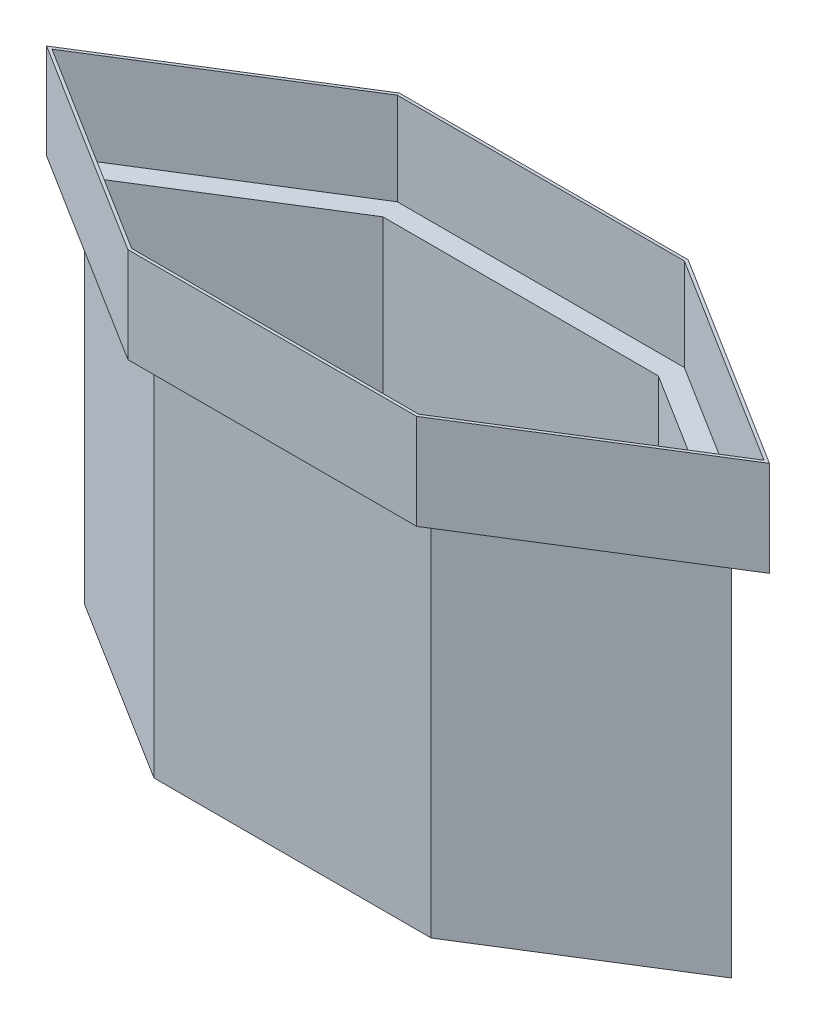
ISO-10303-21;
HEADER;
FILE_DESCRIPTION(('STEP AP214'),'2;1');
FILE_NAME('part.step','',(''),(''),'','','');
FILE_SCHEMA(('AUTOMOTIVE_DESIGN { 1 0 10303 214 1 1 1 1 }'));
ENDSEC;
DATA;
#1=APPLICATION_CONTEXT('core data for automotive mechanical design processes');
#2=APPLICATION_PROTOCOL_DEFINITION('international standard','automotive_design',2000,#1);
#3=PRODUCT_CONTEXT('',#1,'mechanical');
#4=PRODUCT('Part','Part','',(#3));
#5=PRODUCT_RELATED_PRODUCT_CATEGORY('part','',(#4));
#6=PRODUCT_DEFINITION_FORMATION('','',#4);
#7=PRODUCT_DEFINITION_CONTEXT('part definition',#1,'design');
#8=PRODUCT_DEFINITION('design','',#6,#7);
#9=PRODUCT_DEFINITION_SHAPE('','',#8);
#10=(LENGTH_UNIT() NAMED_UNIT(*) SI_UNIT(.MILLI.,.METRE.));
#11=(NAMED_UNIT(*) PLANE_ANGLE_UNIT() SI_UNIT($,.RADIAN.));
#12=(NAMED_UNIT(*) SI_UNIT($,.STERADIAN.) SOLID_ANGLE_UNIT());
#13=UNCERTAINTY_MEASURE_WITH_UNIT(LENGTH_MEASURE(1.E-05),#10,'distance_accuracy_value','');
#14=(GEOMETRIC_REPRESENTATION_CONTEXT(3) GLOBAL_UNCERTAINTY_ASSIGNED_CONTEXT((#13)) GLOBAL_UNIT_ASSIGNED_CONTEXT((#10,
#11,#12)) REPRESENTATION_CONTEXT('',''));
#15=CARTESIAN_POINT('',(0.,0.,0.));
#16=DIRECTION('',(0.,0.,1.));
#17=DIRECTION('',(1.,0.,0.));
#18=AXIS2_PLACEMENT_3D('',#15,#16,#17);
#19=CARTESIAN_POINT('',(152.4,3.175,-127.));
#20=DIRECTION('',(0.,0.,1.));
#21=DIRECTION('',(1.,0.,0.));
#22=AXIS2_PLACEMENT_3D('',#19,#20,#21);
#23=PLANE('',#22);
#24=DIRECTION('',(-1.,0.,0.));
#25=VECTOR('',#24,1.);
#26=CARTESIAN_POINT('',(152.4,0.,-127.));
#27=LINE('',#26,#25);
#28=CARTESIAN_POINT('',(152.4,0.,-127.));
#29=VERTEX_POINT('',#28);
#30=CARTESIAN_POINT('',(-152.4,0.,-127.));
#31=VERTEX_POINT('',#30);
#32=EDGE_CURVE('E357',#29,#31,#27,.T.);
#33=ORIENTED_EDGE('',*,*,#32,.T.);
#34=DIRECTION('',(0.,-1.,0.));
#35=VECTOR('',#34,1.);
#36=CARTESIAN_POINT('',(-152.4,3.175,-127.));
#37=LINE('',#36,#35);
#38=CARTESIAN_POINT('',(-152.4,406.4,-127.));
#39=VERTEX_POINT('',#38);
#40=EDGE_CURVE('E11',#39,#31,#37,.T.);
#41=ORIENTED_EDGE('',*,*,#40,.F.);
#42=DIRECTION('',(-1.,0.,0.));
#43=VECTOR('',#42,1.);
#44=CARTESIAN_POINT('',(152.4,406.4,-127.));
#45=LINE('',#44,#43);
#46=CARTESIAN_POINT('',(152.4,406.4,-127.));
#47=VERTEX_POINT('',#46);
#48=EDGE_CURVE('E348',#47,#39,#45,.T.);
#49=ORIENTED_EDGE('',*,*,#48,.F.);
#50=DIRECTION('',(0.,-1.,0.));
#51=VECTOR('',#50,1.);
#52=CARTESIAN_POINT('',(152.4,3.175,-127.));
#53=LINE('',#52,#51);
#54=EDGE_CURVE('E370',#47,#29,#53,.T.);
#55=ORIENTED_EDGE('',*,*,#54,.T.);
#56=EDGE_LOOP('',(#33,#41,#49,#55));
#57=FACE_BOUND('',#56,.T.);
#58=ADVANCED_FACE('F32',(#57),#23,.F.);
#59=CARTESIAN_POINT('',(-152.4,3.175,-127.));
#60=DIRECTION('',(0.52999894000318,0.,0.847998304005088));
#61=DIRECTION('',(0.847998304005088,0.,-0.52999894000318));
#62=AXIS2_PLACEMENT_3D('',#59,#60,#61);
#63=PLANE('',#62);
#64=DIRECTION('',(-0.847998304005088,0.,0.52999894000318));
#65=VECTOR('',#64,1.);
#66=CARTESIAN_POINT('',(-152.4,0.,-127.));
#67=LINE('',#66,#65);
#68=CARTESIAN_POINT('',(-355.6,0.,0.));
#69=VERTEX_POINT('',#68);
#70=EDGE_CURVE('E360',#31,#69,#67,.T.);
#71=ORIENTED_EDGE('',*,*,#70,.T.);
#72=DIRECTION('',(0.,-1.,0.));
#73=VECTOR('',#72,1.);
#74=CARTESIAN_POINT('',(-355.6,3.175,0.));
#75=LINE('',#74,#73);
#76=CARTESIAN_POINT('',(-355.6,406.4,0.));
#77=VERTEX_POINT('',#76);
#78=EDGE_CURVE('E39',#77,#69,#75,.T.);
#79=ORIENTED_EDGE('',*,*,#78,.F.);
#80=DIRECTION('',(-0.847998304005088,0.,0.52999894000318));
#81=VECTOR('',#80,1.);
#82=CARTESIAN_POINT('',(-152.4,406.4,-127.));
#83=LINE('',#82,#81);
#84=EDGE_CURVE('E351',#39,#77,#83,.T.);
#85=ORIENTED_EDGE('',*,*,#84,.F.);
#86=ORIENTED_EDGE('',*,*,#40,.T.);
#87=EDGE_LOOP('',(#71,#79,#85,#86));
#88=FACE_BOUND('',#87,.T.);
#89=ADVANCED_FACE('F403',(#88),#63,.F.);
#90=CARTESIAN_POINT('',(-355.6,3.175,0.));
#91=DIRECTION('',(0.52999894000318,0.,-0.847998304005088));
#92=DIRECTION('',(-0.847998304005088,0.,-0.52999894000318));
#93=AXIS2_PLACEMENT_3D('',#90,#91,#92);
#94=PLANE('',#93);
#95=DIRECTION('',(0.847998304005088,0.,0.52999894000318));
#96=VECTOR('',#95,1.);
#97=CARTESIAN_POINT('',(-355.6,0.,0.));
#98=LINE('',#97,#96);
#99=CARTESIAN_POINT('',(-152.4,0.,127.));
#100=VERTEX_POINT('',#99);
#101=EDGE_CURVE('E362',#69,#100,#98,.T.);
#102=ORIENTED_EDGE('',*,*,#101,.T.);
#103=DIRECTION('',(0.,-1.,0.));
#104=VECTOR('',#103,1.);
#105=CARTESIAN_POINT('',(-152.4,3.175,127.));
#106=LINE('',#105,#104);
#107=CARTESIAN_POINT('',(-152.4,406.4,127.));
#108=VERTEX_POINT('',#107);
#109=EDGE_CURVE('E379',#108,#100,#106,.T.);
#110=ORIENTED_EDGE('',*,*,#109,.F.);
#111=DIRECTION('',(0.847998304005088,0.,0.52999894000318));
#112=VECTOR('',#111,1.);
#113=CARTESIAN_POINT('',(-355.6,406.4,0.));
#114=LINE('',#113,#112);
#115=EDGE_CURVE('E354',#77,#108,#114,.T.);
#116=ORIENTED_EDGE('',*,*,#115,.F.);
#117=ORIENTED_EDGE('',*,*,#78,.T.);
#118=EDGE_LOOP('',(#102,#110,#116,#117));
#119=FACE_BOUND('',#118,.T.);
#120=ADVANCED_FACE('F385',(#119),#94,.F.);
#121=CARTESIAN_POINT('',(152.4,3.175,127.));
#122=DIRECTION('',(0.,0.,-1.));
#123=DIRECTION('',(-1.,0.,0.));
#124=AXIS2_PLACEMENT_3D('',#121,#122,#123);
#125=PLANE('',#124);
#126=DIRECTION('',(1.,0.,0.));
#127=VECTOR('',#126,1.);
#128=CARTESIAN_POINT('',(152.4,0.,127.));
#129=LINE('',#128,#127);
#130=CARTESIAN_POINT('',(152.4,0.,127.));
#131=VERTEX_POINT('',#130);
#132=EDGE_CURVE('E364',#100,#131,#129,.T.);
#133=ORIENTED_EDGE('',*,*,#132,.T.);
#134=DIRECTION('',(0.,-1.,0.));
#135=VECTOR('',#134,1.);
#136=CARTESIAN_POINT('',(152.4,3.175,127.));
#137=LINE('',#136,#135);
#138=CARTESIAN_POINT('',(152.4,406.4,127.));
#139=VERTEX_POINT('',#138);
#140=EDGE_CURVE('E376',#139,#131,#137,.T.);
#141=ORIENTED_EDGE('',*,*,#140,.F.);
#142=DIRECTION('',(1.,0.,0.));
#143=VECTOR('',#142,1.);
#144=CARTESIAN_POINT('',(-152.4,406.4,127.));
#145=LINE('',#144,#143);
#146=EDGE_CURVE('E339',#108,#139,#145,.T.);
#147=ORIENTED_EDGE('',*,*,#146,.F.);
#148=ORIENTED_EDGE('',*,*,#109,.T.);
#149=EDGE_LOOP('',(#133,#141,#147,#148));
#150=FACE_BOUND('',#149,.T.);
#151=ADVANCED_FACE('F395',(#150),#125,.F.);
#152=CARTESIAN_POINT('',(355.6,3.175,0.));
#153=DIRECTION('',(-0.52999894000318,0.,-0.847998304005088));
#154=DIRECTION('',(-0.847998304005088,0.,0.52999894000318));
#155=AXIS2_PLACEMENT_3D('',#152,#153,#154);
#156=PLANE('',#155);
#157=DIRECTION('',(0.847998304005088,0.,-0.52999894000318));
#158=VECTOR('',#157,1.);
#159=CARTESIAN_POINT('',(355.6,0.,0.));
#160=LINE('',#159,#158);
#161=CARTESIAN_POINT('',(355.6,0.,0.));
#162=VERTEX_POINT('',#161);
#163=EDGE_CURVE('E366',#131,#162,#160,.T.);
#164=ORIENTED_EDGE('',*,*,#163,.T.);
#165=DIRECTION('',(0.,-1.,0.));
#166=VECTOR('',#165,1.);
#167=CARTESIAN_POINT('',(355.6,3.175,0.));
#168=LINE('',#167,#166);
#169=CARTESIAN_POINT('',(355.6,406.4,0.));
#170=VERTEX_POINT('',#169);
#171=EDGE_CURVE('E373',#170,#162,#168,.T.);
#172=ORIENTED_EDGE('',*,*,#171,.F.);
#173=DIRECTION('',(0.847998304005088,0.,-0.52999894000318));
#174=VECTOR('',#173,1.);
#175=CARTESIAN_POINT('',(152.4,406.4,127.));
#176=LINE('',#175,#174);
#177=EDGE_CURVE('E342',#139,#170,#176,.T.);
#178=ORIENTED_EDGE('',*,*,#177,.F.);
#179=ORIENTED_EDGE('',*,*,#140,.T.);
#180=EDGE_LOOP('',(#164,#172,#178,#179));
#181=FACE_BOUND('',#180,.T.);
#182=ADVANCED_FACE('F399',(#181),#156,.F.);
#183=CARTESIAN_POINT('',(152.4,3.175,-127.));
#184=DIRECTION('',(-0.52999894000318,0.,0.847998304005088));
#185=DIRECTION('',(0.847998304005088,0.,0.52999894000318));
#186=AXIS2_PLACEMENT_3D('',#183,#184,#185);
#187=PLANE('',#186);
#188=DIRECTION('',(-0.847998304005088,0.,-0.52999894000318));
#189=VECTOR('',#188,1.);
#190=CARTESIAN_POINT('',(152.4,0.,-127.));
#191=LINE('',#190,#189);
#192=EDGE_CURVE('E368',#162,#29,#191,.T.);
#193=ORIENTED_EDGE('',*,*,#192,.T.);
#194=ORIENTED_EDGE('',*,*,#54,.F.);
#195=DIRECTION('',(-0.847998304005088,0.,-0.52999894000318));
#196=VECTOR('',#195,1.);
#197=CARTESIAN_POINT('',(355.6,406.4,0.));
#198=LINE('',#197,#196);
#199=EDGE_CURVE('E345',#170,#47,#198,.T.);
#200=ORIENTED_EDGE('',*,*,#199,.F.);
#201=ORIENTED_EDGE('',*,*,#171,.T.);
#202=EDGE_LOOP('',(#193,#194,#200,#201));
#203=FACE_BOUND('',#202,.T.);
#204=ADVANCED_FACE('F407',(#203),#187,.F.);
#205=CARTESIAN_POINT('',(0.,0.,0.));
#206=DIRECTION('',(0.,1.,0.));
#207=DIRECTION('',(0.,0.,1.));
#208=AXIS2_PLACEMENT_3D('',#205,#206,#207);
#209=PLANE('',#208);
#210=ORIENTED_EDGE('',*,*,#32,.F.);
#211=ORIENTED_EDGE('',*,*,#192,.F.);
#212=ORIENTED_EDGE('',*,*,#163,.F.);
#213=ORIENTED_EDGE('',*,*,#132,.F.);
#214=ORIENTED_EDGE('',*,*,#101,.F.);
#215=ORIENTED_EDGE('',*,*,#70,.F.);
#216=EDGE_LOOP('',(#210,#211,#212,#213,#214,#215));
#217=FACE_BOUND('',#216,.T.);
#218=ADVANCED_FACE('F391',(#217),#209,.F.);
#219=CARTESIAN_POINT('',(0.,406.4,0.));
#220=DIRECTION('',(0.,1.,0.));
#221=DIRECTION('',(0.,0.,1.));
#222=AXIS2_PLACEMENT_3D('',#219,#220,#221);
#223=PLANE('',#222);
#224=DIRECTION('',(-0.847998304005088,0.,-0.52999894000318));
#225=VECTOR('',#224,1.);
#226=CARTESIAN_POINT('',(397.534046131991,406.4,0.));
#227=LINE('',#226,#225);
#228=CARTESIAN_POINT('',(397.534046131991,406.4,0.));
#229=VERTEX_POINT('',#228);
#230=CARTESIAN_POINT('',(158.774046131992,406.4,-149.225));
#231=VERTEX_POINT('',#230);
#232=EDGE_CURVE('E278',#229,#231,#227,.T.);
#233=ORIENTED_EDGE('',*,*,#232,.F.);
#234=DIRECTION('',(0.847998304005088,0.,-0.52999894000318));
#235=VECTOR('',#234,1.);
#236=CARTESIAN_POINT('',(158.774046131992,406.4,149.225));
#237=LINE('',#236,#235);
#238=CARTESIAN_POINT('',(158.774046131992,406.4,149.225));
#239=VERTEX_POINT('',#238);
#240=EDGE_CURVE('E289',#239,#229,#237,.T.);
#241=ORIENTED_EDGE('',*,*,#240,.F.);
#242=DIRECTION('',(1.,0.,0.));
#243=VECTOR('',#242,1.);
#244=CARTESIAN_POINT('',(-158.774046131992,406.4,149.225));
#245=LINE('',#244,#243);
#246=CARTESIAN_POINT('',(-158.774046131992,406.4,149.225));
#247=VERTEX_POINT('',#246);
#248=EDGE_CURVE('E287',#247,#239,#245,.T.);
#249=ORIENTED_EDGE('',*,*,#248,.F.);
#250=DIRECTION('',(0.847998304005088,0.,0.52999894000318));
#251=VECTOR('',#250,1.);
#252=CARTESIAN_POINT('',(-397.534046131991,406.4,0.));
#253=LINE('',#252,#251);
#254=CARTESIAN_POINT('',(-397.534046131991,406.4,0.));
#255=VERTEX_POINT('',#254);
#256=EDGE_CURVE('E285',#255,#247,#253,.T.);
#257=ORIENTED_EDGE('',*,*,#256,.F.);
#258=DIRECTION('',(-0.847998304005088,0.,0.52999894000318));
#259=VECTOR('',#258,1.);
#260=CARTESIAN_POINT('',(-158.774046131992,406.4,-149.225));
#261=LINE('',#260,#259);
#262=CARTESIAN_POINT('',(-158.774046131992,406.4,-149.225));
#263=VERTEX_POINT('',#262);
#264=EDGE_CURVE('E283',#263,#255,#261,.T.);
#265=ORIENTED_EDGE('',*,*,#264,.F.);
#266=DIRECTION('',(-1.,0.,0.));
#267=VECTOR('',#266,1.);
#268=CARTESIAN_POINT('',(158.774046131992,406.4,-149.225));
#269=LINE('',#268,#267);
#270=EDGE_CURVE('E281',#231,#263,#269,.T.);
#271=ORIENTED_EDGE('',*,*,#270,.F.);
#272=EDGE_LOOP('',(#233,#241,#249,#257,#265,#271));
#273=FACE_BOUND('',#272,.T.);
#274=ORIENTED_EDGE('',*,*,#199,.T.);
#275=ORIENTED_EDGE('',*,*,#48,.T.);
#276=ORIENTED_EDGE('',*,*,#84,.T.);
#277=ORIENTED_EDGE('',*,*,#115,.T.);
#278=ORIENTED_EDGE('',*,*,#146,.T.);
#279=ORIENTED_EDGE('',*,*,#177,.T.);
#280=EDGE_LOOP('',(#274,#275,#276,#277,#278,#279));
#281=FACE_BOUND('',#280,.T.);
#282=ADVANCED_FACE('F402',(#273,#281),#223,.F.);
#283=CARTESIAN_POINT('',(397.534046131991,409.575,0.));
#284=DIRECTION('',(-0.52999894000318,0.,0.847998304005088));
#285=DIRECTION('',(0.847998304005088,0.,0.52999894000318));
#286=AXIS2_PLACEMENT_3D('',#283,#284,#285);
#287=PLANE('',#286);
#288=ORIENTED_EDGE('',*,*,#232,.T.);
#289=DIRECTION('',(0.,-1.,0.));
#290=VECTOR('',#289,1.);
#291=CARTESIAN_POINT('',(158.774046131992,409.575,-149.225));
#292=LINE('',#291,#290);
#293=CARTESIAN_POINT('',(158.774046131992,511.175,-149.225));
#294=VERTEX_POINT('',#293);
#295=EDGE_CURVE('E306',#294,#231,#292,.T.);
#296=ORIENTED_EDGE('',*,*,#295,.F.);
#297=DIRECTION('',(-0.847998304005088,0.,-0.52999894000318));
#298=VECTOR('',#297,1.);
#299=CARTESIAN_POINT('',(397.534046131991,511.175,0.));
#300=LINE('',#299,#298);
#301=CARTESIAN_POINT('',(397.534046131991,511.175,0.));
#302=VERTEX_POINT('',#301);
#303=EDGE_CURVE('E251',#302,#294,#300,.T.);
#304=ORIENTED_EDGE('',*,*,#303,.F.);
#305=DIRECTION('',(0.,-1.,0.));
#306=VECTOR('',#305,1.);
#307=CARTESIAN_POINT('',(397.534046131991,409.575,0.));
#308=LINE('',#307,#306);
#309=EDGE_CURVE('E291',#302,#229,#308,.T.);
#310=ORIENTED_EDGE('',*,*,#309,.T.);
#311=EDGE_LOOP('',(#288,#296,#304,#310));
#312=FACE_BOUND('',#311,.T.);
#313=ADVANCED_FACE('F450',(#312),#287,.F.);
#314=CARTESIAN_POINT('',(158.774046131992,409.575,-149.225));
#315=DIRECTION('',(0.,0.,1.));
#316=DIRECTION('',(1.,0.,0.));
#317=AXIS2_PLACEMENT_3D('',#314,#315,#316);
#318=PLANE('',#317);
#319=ORIENTED_EDGE('',*,*,#270,.T.);
#320=DIRECTION('',(0.,-1.,0.));
#321=VECTOR('',#320,1.);
#322=CARTESIAN_POINT('',(-158.774046131992,409.575,-149.225));
#323=LINE('',#322,#321);
#324=CARTESIAN_POINT('',(-158.774046131992,511.175,-149.225));
#325=VERTEX_POINT('',#324);
#326=EDGE_CURVE('E303',#325,#263,#323,.T.);
#327=ORIENTED_EDGE('',*,*,#326,.F.);
#328=DIRECTION('',(-1.,0.,0.));
#329=VECTOR('',#328,1.);
#330=CARTESIAN_POINT('',(158.774046131992,511.175,-149.225));
#331=LINE('',#330,#329);
#332=EDGE_CURVE('E254',#294,#325,#331,.T.);
#333=ORIENTED_EDGE('',*,*,#332,.F.);
#334=ORIENTED_EDGE('',*,*,#295,.T.);
#335=EDGE_LOOP('',(#319,#327,#333,#334));
#336=FACE_BOUND('',#335,.T.);
#337=ADVANCED_FACE('F531',(#336),#318,.F.);
#338=CARTESIAN_POINT('',(-158.774046131992,409.575,-149.225));
#339=DIRECTION('',(0.52999894000318,0.,0.847998304005088));
#340=DIRECTION('',(0.847998304005088,0.,-0.52999894000318));
#341=AXIS2_PLACEMENT_3D('',#338,#339,#340);
#342=PLANE('',#341);
#343=ORIENTED_EDGE('',*,*,#264,.T.);
#344=DIRECTION('',(0.,-1.,0.));
#345=VECTOR('',#344,1.);
#346=CARTESIAN_POINT('',(-397.534046131991,409.575,0.));
#347=LINE('',#346,#345);
#348=CARTESIAN_POINT('',(-397.534046131991,511.175,0.));
#349=VERTEX_POINT('',#348);
#350=EDGE_CURVE('E300',#349,#255,#347,.T.);
#351=ORIENTED_EDGE('',*,*,#350,.F.);
#352=DIRECTION('',(-0.847998304005088,0.,0.52999894000318));
#353=VECTOR('',#352,1.);
#354=CARTESIAN_POINT('',(-158.774046131992,511.175,-149.225));
#355=LINE('',#354,#353);
#356=EDGE_CURVE('E257',#325,#349,#355,.T.);
#357=ORIENTED_EDGE('',*,*,#356,.F.);
#358=ORIENTED_EDGE('',*,*,#326,.T.);
#359=EDGE_LOOP('',(#343,#351,#357,#358));
#360=FACE_BOUND('',#359,.T.);
#361=ADVANCED_FACE('F542',(#360),#342,.F.);
#362=CARTESIAN_POINT('',(-397.534046131991,409.575,0.));
#363=DIRECTION('',(0.52999894000318,0.,-0.847998304005088));
#364=DIRECTION('',(-0.847998304005088,0.,-0.52999894000318));
#365=AXIS2_PLACEMENT_3D('',#362,#363,#364);
#366=PLANE('',#365);
#367=ORIENTED_EDGE('',*,*,#256,.T.);
#368=DIRECTION('',(0.,-1.,0.));
#369=VECTOR('',#368,1.);
#370=CARTESIAN_POINT('',(-158.774046131992,409.575,149.225));
#371=LINE('',#370,#369);
#372=CARTESIAN_POINT('',(-158.774046131992,511.175,149.225));
#373=VERTEX_POINT('',#372);
#374=EDGE_CURVE('E297',#373,#247,#371,.T.);
#375=ORIENTED_EDGE('',*,*,#374,.F.);
#376=DIRECTION('',(0.847998304005088,0.,0.52999894000318));
#377=VECTOR('',#376,1.);
#378=CARTESIAN_POINT('',(-397.534046131991,511.175,0.));
#379=LINE('',#378,#377);
#380=EDGE_CURVE('E206',#349,#373,#379,.T.);
#381=ORIENTED_EDGE('',*,*,#380,.F.);
#382=ORIENTED_EDGE('',*,*,#350,.T.);
#383=EDGE_LOOP('',(#367,#375,#381,#382));
#384=FACE_BOUND('',#383,.T.);
#385=ADVANCED_FACE('F553',(#384),#366,.F.);
#386=CARTESIAN_POINT('',(-158.774046131992,409.575,149.225));
#387=DIRECTION('',(0.,0.,-1.));
#388=DIRECTION('',(-1.,0.,0.));
#389=AXIS2_PLACEMENT_3D('',#386,#387,#388);
#390=PLANE('',#389);
#391=ORIENTED_EDGE('',*,*,#248,.T.);
#392=DIRECTION('',(0.,-1.,0.));
#393=VECTOR('',#392,1.);
#394=CARTESIAN_POINT('',(158.774046131992,409.575,149.225));
#395=LINE('',#394,#393);
#396=CARTESIAN_POINT('',(158.774046131992,511.175,149.225));
#397=VERTEX_POINT('',#396);
#398=EDGE_CURVE('E294',#397,#239,#395,.T.);
#399=ORIENTED_EDGE('',*,*,#398,.F.);
#400=DIRECTION('',(1.,0.,0.));
#401=VECTOR('',#400,1.);
#402=CARTESIAN_POINT('',(-158.774046131992,511.175,149.225));
#403=LINE('',#402,#401);
#404=EDGE_CURVE('E245',#373,#397,#403,.T.);
#405=ORIENTED_EDGE('',*,*,#404,.F.);
#406=ORIENTED_EDGE('',*,*,#374,.T.);
#407=EDGE_LOOP('',(#391,#399,#405,#406));
#408=FACE_BOUND('',#407,.T.);
#409=ADVANCED_FACE('F564',(#408),#390,.F.);
#410=CARTESIAN_POINT('',(158.774046131992,409.575,149.225));
#411=DIRECTION('',(-0.52999894000318,0.,-0.847998304005088));
#412=DIRECTION('',(-0.847998304005088,0.,0.52999894000318));
#413=AXIS2_PLACEMENT_3D('',#410,#411,#412);
#414=PLANE('',#413);
#415=ORIENTED_EDGE('',*,*,#240,.T.);
#416=ORIENTED_EDGE('',*,*,#309,.F.);
#417=DIRECTION('',(0.847998304005088,0.,-0.52999894000318));
#418=VECTOR('',#417,1.);
#419=CARTESIAN_POINT('',(158.774046131992,511.175,149.225));
#420=LINE('',#419,#418);
#421=EDGE_CURVE('E248',#397,#302,#420,.T.);
#422=ORIENTED_EDGE('',*,*,#421,.F.);
#423=ORIENTED_EDGE('',*,*,#398,.T.);
#424=EDGE_LOOP('',(#415,#416,#422,#423));
#425=FACE_BOUND('',#424,.T.);
#426=ADVANCED_FACE('F575',(#425),#414,.F.);
#427=CARTESIAN_POINT('',(0.,511.175,0.));
#428=DIRECTION('',(0.,1.,0.));
#429=DIRECTION('',(0.,0.,1.));
#430=AXIS2_PLACEMENT_3D('',#427,#428,#429);
#431=PLANE('',#430);
#432=ORIENTED_EDGE('',*,*,#380,.T.);
#433=ORIENTED_EDGE('',*,*,#404,.T.);
#434=ORIENTED_EDGE('',*,*,#421,.T.);
#435=ORIENTED_EDGE('',*,*,#303,.T.);
#436=ORIENTED_EDGE('',*,*,#332,.T.);
#437=ORIENTED_EDGE('',*,*,#356,.T.);
#438=EDGE_LOOP('',(#432,#433,#434,#435,#436,#437));
#439=FACE_BOUND('',#438,.T.);
#440=DIRECTION('',(-0.847998304005088,0.,0.52999894000318));
#441=VECTOR('',#440,1.);
#442=CARTESIAN_POINT('',(-157.863468113136,511.175,-146.05));
#443=LINE('',#442,#441);
#444=CARTESIAN_POINT('',(-157.863468113136,511.175,-146.05));
#445=VERTEX_POINT('',#444);
#446=CARTESIAN_POINT('',(-391.543468113136,511.175,0.));
#447=VERTEX_POINT('',#446);
#448=EDGE_CURVE('E200',#445,#447,#443,.T.);
#449=ORIENTED_EDGE('',*,*,#448,.F.);
#450=DIRECTION('',(-1.,0.,0.));
#451=VECTOR('',#450,1.);
#452=CARTESIAN_POINT('',(157.863468113136,511.175,-146.05));
#453=LINE('',#452,#451);
#454=CARTESIAN_POINT('',(157.863468113136,511.175,-146.05));
#455=VERTEX_POINT('',#454);
#456=EDGE_CURVE('E191',#455,#445,#453,.T.);
#457=ORIENTED_EDGE('',*,*,#456,.F.);
#458=DIRECTION('',(-0.847998304005088,0.,-0.52999894000318));
#459=VECTOR('',#458,1.);
#460=CARTESIAN_POINT('',(391.543468113136,511.175,0.));
#461=LINE('',#460,#459);
#462=CARTESIAN_POINT('',(391.543468113136,511.175,0.));
#463=VERTEX_POINT('',#462);
#464=EDGE_CURVE('E221',#463,#455,#461,.T.);
#465=ORIENTED_EDGE('',*,*,#464,.F.);
#466=DIRECTION('',(0.847998304005088,0.,-0.52999894000318));
#467=VECTOR('',#466,1.);
#468=CARTESIAN_POINT('',(157.863468113136,511.175,146.05));
#469=LINE('',#468,#467);
#470=CARTESIAN_POINT('',(157.863468113136,511.175,146.05));
#471=VERTEX_POINT('',#470);
#472=EDGE_CURVE('E218',#471,#463,#469,.T.);
#473=ORIENTED_EDGE('',*,*,#472,.F.);
#474=DIRECTION('',(1.,0.,0.));
#475=VECTOR('',#474,1.);
#476=CARTESIAN_POINT('',(-157.863468113136,511.175,146.05));
#477=LINE('',#476,#475);
#478=CARTESIAN_POINT('',(-157.863468113136,511.175,146.05));
#479=VERTEX_POINT('',#478);
#480=EDGE_CURVE('E214',#479,#471,#477,.T.);
#481=ORIENTED_EDGE('',*,*,#480,.F.);
#482=DIRECTION('',(0.847998304005088,0.,0.52999894000318));
#483=VECTOR('',#482,1.);
#484=CARTESIAN_POINT('',(-391.543468113136,511.175,0.));
#485=LINE('',#484,#483);
#486=EDGE_CURVE('E212',#447,#479,#485,.T.);
#487=ORIENTED_EDGE('',*,*,#486,.F.);
#488=EDGE_LOOP('',(#449,#457,#465,#473,#481,#487));
#489=FACE_BOUND('',#488,.T.);
#490=ADVANCED_FACE('F210',(#439,#489),#431,.T.);
#491=CARTESIAN_POINT('',(157.863468113136,511.175,-146.05));
#492=DIRECTION('',(0.,0.,1.));
#493=DIRECTION('',(1.,0.,0.));
#494=AXIS2_PLACEMENT_3D('',#491,#492,#493);
#495=PLANE('',#494);
#496=DIRECTION('',(-1.,0.,0.));
#497=VECTOR('',#496,1.);
#498=CARTESIAN_POINT('',(157.863468113136,409.575,-146.05));
#499=LINE('',#498,#497);
#500=CARTESIAN_POINT('',(157.863468113136,409.575,-146.05));
#501=VERTEX_POINT('',#500);
#502=CARTESIAN_POINT('',(-157.863468113136,409.575,-146.05));
#503=VERTEX_POINT('',#502);
#504=EDGE_CURVE('E46',#501,#503,#499,.T.);
#505=ORIENTED_EDGE('',*,*,#504,.F.);
#506=DIRECTION('',(0.,-1.,0.));
#507=VECTOR('',#506,1.);
#508=CARTESIAN_POINT('',(157.863468113136,511.175,-146.05));
#509=LINE('',#508,#507);
#510=EDGE_CURVE('E196',#455,#501,#509,.T.);
#511=ORIENTED_EDGE('',*,*,#510,.F.);
#512=ORIENTED_EDGE('',*,*,#456,.T.);
#513=DIRECTION('',(0.,-1.,0.));
#514=VECTOR('',#513,1.);
#515=CARTESIAN_POINT('',(-157.863468113136,511.175,-146.05));
#516=LINE('',#515,#514);
#517=EDGE_CURVE('E194',#445,#503,#516,.T.);
#518=ORIENTED_EDGE('',*,*,#517,.T.);
#519=EDGE_LOOP('',(#505,#511,#512,#518));
#520=FACE_BOUND('',#519,.T.);
#521=ADVANCED_FACE('F193',(#520),#495,.T.);
#522=CARTESIAN_POINT('',(-157.863468113136,511.175,-146.05));
#523=DIRECTION('',(0.52999894000318,0.,0.847998304005088));
#524=DIRECTION('',(0.847998304005088,0.,-0.52999894000318));
#525=AXIS2_PLACEMENT_3D('',#522,#523,#524);
#526=PLANE('',#525);
#527=DIRECTION('',(-0.847998304005088,0.,0.52999894000318));
#528=VECTOR('',#527,1.);
#529=CARTESIAN_POINT('',(-157.863468113136,409.575,-146.05));
#530=LINE('',#529,#528);
#531=CARTESIAN_POINT('',(-391.543468113136,409.575,0.));
#532=VERTEX_POINT('',#531);
#533=EDGE_CURVE('E50',#503,#532,#530,.T.);
#534=ORIENTED_EDGE('',*,*,#533,.F.);
#535=ORIENTED_EDGE('',*,*,#517,.F.);
#536=ORIENTED_EDGE('',*,*,#448,.T.);
#537=DIRECTION('',(0.,-1.,0.));
#538=VECTOR('',#537,1.);
#539=CARTESIAN_POINT('',(-391.543468113136,511.175,0.));
#540=LINE('',#539,#538);
#541=EDGE_CURVE('E207',#447,#532,#540,.T.);
#542=ORIENTED_EDGE('',*,*,#541,.T.);
#543=EDGE_LOOP('',(#534,#535,#536,#542));
#544=FACE_BOUND('',#543,.T.);
#545=ADVANCED_FACE('F204',(#544),#526,.T.);
#546=CARTESIAN_POINT('',(-391.543468113136,511.175,0.));
#547=DIRECTION('',(0.52999894000318,0.,-0.847998304005088));
#548=DIRECTION('',(-0.847998304005088,0.,-0.52999894000318));
#549=AXIS2_PLACEMENT_3D('',#546,#547,#548);
#550=PLANE('',#549);
#551=DIRECTION('',(0.847998304005088,0.,0.52999894000318));
#552=VECTOR('',#551,1.);
#553=CARTESIAN_POINT('',(-391.543468113136,409.575,0.));
#554=LINE('',#553,#552);
#555=CARTESIAN_POINT('',(-157.863468113136,409.575,146.05));
#556=VERTEX_POINT('',#555);
#557=EDGE_CURVE('E225',#532,#556,#554,.T.);
#558=ORIENTED_EDGE('',*,*,#557,.F.);
#559=ORIENTED_EDGE('',*,*,#541,.F.);
#560=ORIENTED_EDGE('',*,*,#486,.T.);
#561=DIRECTION('',(0.,-1.,0.));
#562=VECTOR('',#561,1.);
#563=CARTESIAN_POINT('',(-157.863468113136,511.175,146.05));
#564=LINE('',#563,#562);
#565=EDGE_CURVE('E239',#479,#556,#564,.T.);
#566=ORIENTED_EDGE('',*,*,#565,.T.);
#567=EDGE_LOOP('',(#558,#559,#560,#566));
#568=FACE_BOUND('',#567,.T.);
#569=ADVANCED_FACE('F612',(#568),#550,.T.);
#570=CARTESIAN_POINT('',(-157.863468113136,511.175,146.05));
#571=DIRECTION('',(0.,0.,-1.));
#572=DIRECTION('',(-1.,0.,0.));
#573=AXIS2_PLACEMENT_3D('',#570,#571,#572);
#574=PLANE('',#573);
#575=DIRECTION('',(1.,0.,0.));
#576=VECTOR('',#575,1.);
#577=CARTESIAN_POINT('',(-157.863468113136,409.575,146.05));
#578=LINE('',#577,#576);
#579=CARTESIAN_POINT('',(157.863468113136,409.575,146.05));
#580=VERTEX_POINT('',#579);
#581=EDGE_CURVE('E227',#556,#580,#578,.T.);
#582=ORIENTED_EDGE('',*,*,#581,.F.);
#583=ORIENTED_EDGE('',*,*,#565,.F.);
#584=ORIENTED_EDGE('',*,*,#480,.T.);
#585=DIRECTION('',(0.,-1.,0.));
#586=VECTOR('',#585,1.);
#587=CARTESIAN_POINT('',(157.863468113136,511.175,146.05));
#588=LINE('',#587,#586);
#589=EDGE_CURVE('E236',#471,#580,#588,.T.);
#590=ORIENTED_EDGE('',*,*,#589,.T.);
#591=EDGE_LOOP('',(#582,#583,#584,#590));
#592=FACE_BOUND('',#591,.T.);
#593=ADVANCED_FACE('F621',(#592),#574,.T.);
#594=CARTESIAN_POINT('',(157.863468113136,511.175,146.05));
#595=DIRECTION('',(-0.52999894000318,0.,-0.847998304005088));
#596=DIRECTION('',(-0.847998304005088,0.,0.52999894000318));
#597=AXIS2_PLACEMENT_3D('',#594,#595,#596);
#598=PLANE('',#597);
#599=DIRECTION('',(0.847998304005088,0.,-0.52999894000318));
#600=VECTOR('',#599,1.);
#601=CARTESIAN_POINT('',(157.863468113136,409.575,146.05));
#602=LINE('',#601,#600);
#603=CARTESIAN_POINT('',(391.543468113136,409.575,0.));
#604=VERTEX_POINT('',#603);
#605=EDGE_CURVE('E229',#580,#604,#602,.T.);
#606=ORIENTED_EDGE('',*,*,#605,.F.);
#607=ORIENTED_EDGE('',*,*,#589,.F.);
#608=ORIENTED_EDGE('',*,*,#472,.T.);
#609=DIRECTION('',(0.,-1.,0.));
#610=VECTOR('',#609,1.);
#611=CARTESIAN_POINT('',(391.543468113136,511.175,0.));
#612=LINE('',#611,#610);
#613=EDGE_CURVE('E233',#463,#604,#612,.T.);
#614=ORIENTED_EDGE('',*,*,#613,.T.);
#615=EDGE_LOOP('',(#606,#607,#608,#614));
#616=FACE_BOUND('',#615,.T.);
#617=ADVANCED_FACE('F631',(#616),#598,.T.);
#618=CARTESIAN_POINT('',(391.543468113136,511.175,0.));
#619=DIRECTION('',(-0.52999894000318,0.,0.847998304005088));
#620=DIRECTION('',(0.847998304005088,0.,0.52999894000318));
#621=AXIS2_PLACEMENT_3D('',#618,#619,#620);
#622=PLANE('',#621);
#623=DIRECTION('',(-0.847998304005088,0.,-0.52999894000318));
#624=VECTOR('',#623,1.);
#625=CARTESIAN_POINT('',(391.543468113136,409.575,0.));
#626=LINE('',#625,#624);
#627=EDGE_CURVE('E201',#604,#501,#626,.T.);
#628=ORIENTED_EDGE('',*,*,#627,.F.);
#629=ORIENTED_EDGE('',*,*,#613,.F.);
#630=ORIENTED_EDGE('',*,*,#464,.T.);
#631=ORIENTED_EDGE('',*,*,#510,.T.);
#632=EDGE_LOOP('',(#628,#629,#630,#631));
#633=FACE_BOUND('',#632,.T.);
#634=ADVANCED_FACE('F641',(#633),#622,.T.);
#635=CARTESIAN_POINT('',(0.,3.175,0.));
#636=DIRECTION('',(0.,1.,0.));
#637=DIRECTION('',(0.,0.,1.));
#638=AXIS2_PLACEMENT_3D('',#635,#636,#637);
#639=PLANE('',#638);
#640=DIRECTION('',(1.,0.,0.));
#641=VECTOR('',#640,1.);
#642=CARTESIAN_POINT('',(-151.489421981144,3.175,123.825));
#643=LINE('',#642,#641);
#644=CARTESIAN_POINT('',(-151.489421981144,3.175,123.825));
#645=VERTEX_POINT('',#644);
#646=CARTESIAN_POINT('',(151.489421981144,3.175,123.825));
#647=VERTEX_POINT('',#646);
#648=EDGE_CURVE('E309',#645,#647,#643,.T.);
#649=ORIENTED_EDGE('',*,*,#648,.T.);
#650=DIRECTION('',(0.847998304005088,0.,-0.52999894000318));
#651=VECTOR('',#650,1.);
#652=CARTESIAN_POINT('',(151.489421981144,3.175,123.825));
#653=LINE('',#652,#651);
#654=CARTESIAN_POINT('',(349.609421981144,3.175,0.));
#655=VERTEX_POINT('',#654);
#656=EDGE_CURVE('E311',#647,#655,#653,.T.);
#657=ORIENTED_EDGE('',*,*,#656,.T.);
#658=DIRECTION('',(-0.847998304005088,0.,-0.52999894000318));
#659=VECTOR('',#658,1.);
#660=CARTESIAN_POINT('',(349.609421981144,3.175,0.));
#661=LINE('',#660,#659);
#662=CARTESIAN_POINT('',(151.489421981144,3.175,-123.825));
#663=VERTEX_POINT('',#662);
#664=EDGE_CURVE('E313',#655,#663,#661,.T.);
#665=ORIENTED_EDGE('',*,*,#664,.T.);
#666=DIRECTION('',(-1.,0.,0.));
#667=VECTOR('',#666,1.);
#668=CARTESIAN_POINT('',(151.489421981144,3.175,-123.825));
#669=LINE('',#668,#667);
#670=CARTESIAN_POINT('',(-151.489421981144,3.175,-123.825));
#671=VERTEX_POINT('',#670);
#672=EDGE_CURVE('E315',#663,#671,#669,.T.);
#673=ORIENTED_EDGE('',*,*,#672,.T.);
#674=DIRECTION('',(-0.847998304005088,0.,0.52999894000318));
#675=VECTOR('',#674,1.);
#676=CARTESIAN_POINT('',(-151.489421981144,3.175,-123.825));
#677=LINE('',#676,#675);
#678=CARTESIAN_POINT('',(-349.609421981144,3.175,0.));
#679=VERTEX_POINT('',#678);
#680=EDGE_CURVE('E317',#671,#679,#677,.T.);
#681=ORIENTED_EDGE('',*,*,#680,.T.);
#682=DIRECTION('',(0.847998304005088,0.,0.52999894000318));
#683=VECTOR('',#682,1.);
#684=CARTESIAN_POINT('',(-349.609421981144,3.175,0.));
#685=LINE('',#684,#683);
#686=EDGE_CURVE('E319',#679,#645,#685,.T.);
#687=ORIENTED_EDGE('',*,*,#686,.T.);
#688=EDGE_LOOP('',(#649,#657,#665,#673,#681,#687));
#689=FACE_BOUND('',#688,.T.);
#690=ADVANCED_FACE('F477',(#689),#639,.T.);
#691=CARTESIAN_POINT('',(-151.489421981144,406.4,-123.825));
#692=DIRECTION('',(0.52999894000318,0.,0.847998304005088));
#693=DIRECTION('',(0.847998304005088,0.,-0.52999894000318));
#694=AXIS2_PLACEMENT_3D('',#691,#692,#693);
#695=PLANE('',#694);
#696=ORIENTED_EDGE('',*,*,#680,.F.);
#697=DIRECTION('',(0.,-1.,0.));
#698=VECTOR('',#697,1.);
#699=CARTESIAN_POINT('',(-151.489421981144,406.4,-123.825));
#700=LINE('',#699,#698);
#701=CARTESIAN_POINT('',(-151.489421981144,409.575,-123.825));
#702=VERTEX_POINT('',#701);
#703=EDGE_CURVE('E327',#702,#671,#700,.T.);
#704=ORIENTED_EDGE('',*,*,#703,.F.);
#705=DIRECTION('',(-0.847998304005088,0.,0.52999894000318));
#706=VECTOR('',#705,1.);
#707=CARTESIAN_POINT('',(-151.489421981144,409.575,-123.825));
#708=LINE('',#707,#706);
#709=CARTESIAN_POINT('',(-349.609421981144,409.575,0.));
#710=VERTEX_POINT('',#709);
#711=EDGE_CURVE('E266',#702,#710,#708,.T.);
#712=ORIENTED_EDGE('',*,*,#711,.T.);
#713=DIRECTION('',(0.,-1.,0.));
#714=VECTOR('',#713,1.);
#715=CARTESIAN_POINT('',(-349.609421981144,406.4,0.));
#716=LINE('',#715,#714);
#717=EDGE_CURVE('E324',#710,#679,#716,.T.);
#718=ORIENTED_EDGE('',*,*,#717,.T.);
#719=EDGE_LOOP('',(#696,#704,#712,#718));
#720=FACE_BOUND('',#719,.T.);
#721=ADVANCED_FACE('F465',(#720),#695,.T.);
#722=CARTESIAN_POINT('',(-349.609421981144,406.4,0.));
#723=DIRECTION('',(0.52999894000318,0.,-0.847998304005088));
#724=DIRECTION('',(-0.847998304005088,0.,-0.52999894000318));
#725=AXIS2_PLACEMENT_3D('',#722,#723,#724);
#726=PLANE('',#725);
#727=ORIENTED_EDGE('',*,*,#686,.F.);
#728=ORIENTED_EDGE('',*,*,#717,.F.);
#729=DIRECTION('',(0.847998304005088,0.,0.52999894000318));
#730=VECTOR('',#729,1.);
#731=CARTESIAN_POINT('',(-349.609421981144,409.575,0.));
#732=LINE('',#731,#730);
#733=CARTESIAN_POINT('',(-151.489421981144,409.575,123.825));
#734=VERTEX_POINT('',#733);
#735=EDGE_CURVE('E269',#710,#734,#732,.T.);
#736=ORIENTED_EDGE('',*,*,#735,.T.);
#737=DIRECTION('',(0.,-1.,0.));
#738=VECTOR('',#737,1.);
#739=CARTESIAN_POINT('',(-151.489421981144,406.4,123.825));
#740=LINE('',#739,#738);
#741=EDGE_CURVE('E321',#734,#645,#740,.T.);
#742=ORIENTED_EDGE('',*,*,#741,.T.);
#743=EDGE_LOOP('',(#727,#728,#736,#742));
#744=FACE_BOUND('',#743,.T.);
#745=ADVANCED_FACE('F459',(#744),#726,.T.);
#746=CARTESIAN_POINT('',(-151.489421981144,406.4,123.825));
#747=DIRECTION('',(0.,0.,-1.));
#748=DIRECTION('',(-1.,0.,0.));
#749=AXIS2_PLACEMENT_3D('',#746,#747,#748);
#750=PLANE('',#749);
#751=ORIENTED_EDGE('',*,*,#648,.F.);
#752=ORIENTED_EDGE('',*,*,#741,.F.);
#753=DIRECTION('',(1.,0.,0.));
#754=VECTOR('',#753,1.);
#755=CARTESIAN_POINT('',(-151.489421981144,409.575,123.825));
#756=LINE('',#755,#754);
#757=CARTESIAN_POINT('',(151.489421981144,409.575,123.825));
#758=VERTEX_POINT('',#757);
#759=EDGE_CURVE('E272',#734,#758,#756,.T.);
#760=ORIENTED_EDGE('',*,*,#759,.T.);
#761=DIRECTION('',(0.,-1.,0.));
#762=VECTOR('',#761,1.);
#763=CARTESIAN_POINT('',(151.489421981144,406.4,123.825));
#764=LINE('',#763,#762);
#765=EDGE_CURVE('E336',#758,#647,#764,.T.);
#766=ORIENTED_EDGE('',*,*,#765,.T.);
#767=EDGE_LOOP('',(#751,#752,#760,#766));
#768=FACE_BOUND('',#767,.T.);
#769=ADVANCED_FACE('F464',(#768),#750,.T.);
#770=CARTESIAN_POINT('',(151.489421981144,406.4,123.825));
#771=DIRECTION('',(-0.52999894000318,0.,-0.847998304005088));
#772=DIRECTION('',(-0.847998304005088,0.,0.52999894000318));
#773=AXIS2_PLACEMENT_3D('',#770,#771,#772);
#774=PLANE('',#773);
#775=ORIENTED_EDGE('',*,*,#656,.F.);
#776=ORIENTED_EDGE('',*,*,#765,.F.);
#777=DIRECTION('',(0.847998304005088,0.,-0.52999894000318));
#778=VECTOR('',#777,1.);
#779=CARTESIAN_POINT('',(151.489421981144,409.575,123.825));
#780=LINE('',#779,#778);
#781=CARTESIAN_POINT('',(349.609421981144,409.575,0.));
#782=VERTEX_POINT('',#781);
#783=EDGE_CURVE('E275',#758,#782,#780,.T.);
#784=ORIENTED_EDGE('',*,*,#783,.T.);
#785=DIRECTION('',(0.,-1.,0.));
#786=VECTOR('',#785,1.);
#787=CARTESIAN_POINT('',(349.609421981144,406.4,0.));
#788=LINE('',#787,#786);
#789=EDGE_CURVE('E333',#782,#655,#788,.T.);
#790=ORIENTED_EDGE('',*,*,#789,.T.);
#791=EDGE_LOOP('',(#775,#776,#784,#790));
#792=FACE_BOUND('',#791,.T.);
#793=ADVANCED_FACE('F503',(#792),#774,.T.);
#794=CARTESIAN_POINT('',(349.609421981144,406.4,0.));
#795=DIRECTION('',(-0.52999894000318,0.,0.847998304005088));
#796=DIRECTION('',(0.847998304005088,0.,0.52999894000318));
#797=AXIS2_PLACEMENT_3D('',#794,#795,#796);
#798=PLANE('',#797);
#799=ORIENTED_EDGE('',*,*,#664,.F.);
#800=ORIENTED_EDGE('',*,*,#789,.F.);
#801=DIRECTION('',(-0.847998304005088,0.,-0.52999894000318));
#802=VECTOR('',#801,1.);
#803=CARTESIAN_POINT('',(349.609421981144,409.575,0.));
#804=LINE('',#803,#802);
#805=CARTESIAN_POINT('',(151.489421981144,409.575,-123.825));
#806=VERTEX_POINT('',#805);
#807=EDGE_CURVE('E260',#782,#806,#804,.T.);
#808=ORIENTED_EDGE('',*,*,#807,.T.);
#809=DIRECTION('',(0.,-1.,0.));
#810=VECTOR('',#809,1.);
#811=CARTESIAN_POINT('',(151.489421981144,406.4,-123.825));
#812=LINE('',#811,#810);
#813=EDGE_CURVE('E330',#806,#663,#812,.T.);
#814=ORIENTED_EDGE('',*,*,#813,.T.);
#815=EDGE_LOOP('',(#799,#800,#808,#814));
#816=FACE_BOUND('',#815,.T.);
#817=ADVANCED_FACE('F491',(#816),#798,.T.);
#818=CARTESIAN_POINT('',(151.489421981144,406.4,-123.825));
#819=DIRECTION('',(0.,0.,1.));
#820=DIRECTION('',(1.,0.,0.));
#821=AXIS2_PLACEMENT_3D('',#818,#819,#820);
#822=PLANE('',#821);
#823=ORIENTED_EDGE('',*,*,#672,.F.);
#824=ORIENTED_EDGE('',*,*,#813,.F.);
#825=DIRECTION('',(-1.,0.,0.));
#826=VECTOR('',#825,1.);
#827=CARTESIAN_POINT('',(151.489421981144,409.575,-123.825));
#828=LINE('',#827,#826);
#829=EDGE_CURVE('E263',#806,#702,#828,.T.);
#830=ORIENTED_EDGE('',*,*,#829,.T.);
#831=ORIENTED_EDGE('',*,*,#703,.T.);
#832=EDGE_LOOP('',(#823,#824,#830,#831));
#833=FACE_BOUND('',#832,.T.);
#834=ADVANCED_FACE('F486',(#833),#822,.T.);
#835=CARTESIAN_POINT('',(0.,409.575,0.));
#836=DIRECTION('',(0.,1.,0.));
#837=DIRECTION('',(0.,0.,1.));
#838=AXIS2_PLACEMENT_3D('',#835,#836,#837);
#839=PLANE('',#838);
#840=ORIENTED_EDGE('',*,*,#504,.T.);
#841=ORIENTED_EDGE('',*,*,#533,.T.);
#842=ORIENTED_EDGE('',*,*,#557,.T.);
#843=ORIENTED_EDGE('',*,*,#581,.T.);
#844=ORIENTED_EDGE('',*,*,#605,.T.);
#845=ORIENTED_EDGE('',*,*,#627,.T.);
#846=EDGE_LOOP('',(#840,#841,#842,#843,#844,#845));
#847=FACE_BOUND('',#846,.T.);
#848=ORIENTED_EDGE('',*,*,#829,.F.);
#849=ORIENTED_EDGE('',*,*,#807,.F.);
#850=ORIENTED_EDGE('',*,*,#783,.F.);
#851=ORIENTED_EDGE('',*,*,#759,.F.);
#852=ORIENTED_EDGE('',*,*,#735,.F.);
#853=ORIENTED_EDGE('',*,*,#711,.F.);
#854=EDGE_LOOP('',(#848,#849,#850,#851,#852,#853));
#855=FACE_BOUND('',#854,.T.);
#856=ADVANCED_FACE('F490',(#847,#855),#839,.T.);
#857=CLOSED_SHELL('',(#58,#89,#120,#151,#182,#204,#218,#282,#313,#337,#361,#385,#409,#426,#490,
#521,#545,#569,#593,#617,#634,#690,#721,#745,#769,#793,#817,#834,#856));
#858=MANIFOLD_SOLID_BREP('B2',#857);
#859=ADVANCED_BREP_SHAPE_REPRESENTATION('',(#18,#858),#14);
#860=SHAPE_DEFINITION_REPRESENTATION(#9,#859);
ENDSEC;
END-ISO-10303-21;
